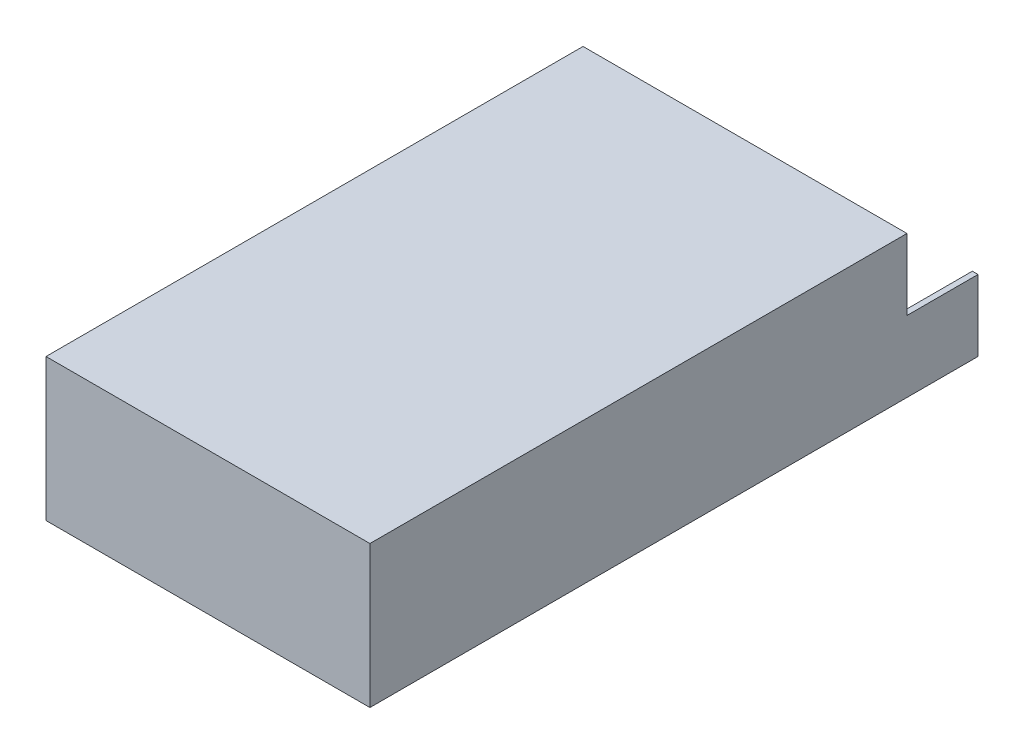
ISO-10303-21;
HEADER;
FILE_DESCRIPTION(('STEP AP214'),'2;1');
FILE_NAME('part.step','',(''),(''),'','','');
FILE_SCHEMA(('AUTOMOTIVE_DESIGN { 1 0 10303 214 1 1 1 1 }'));
ENDSEC;
DATA;
#1=APPLICATION_CONTEXT('core data for automotive mechanical design processes');
#2=APPLICATION_PROTOCOL_DEFINITION('international standard','automotive_design',2000,#1);
#3=PRODUCT_CONTEXT('',#1,'mechanical');
#4=PRODUCT('Part','Part','',(#3));
#5=PRODUCT_RELATED_PRODUCT_CATEGORY('part','',(#4));
#6=PRODUCT_DEFINITION_FORMATION('','',#4);
#7=PRODUCT_DEFINITION_CONTEXT('part definition',#1,'design');
#8=PRODUCT_DEFINITION('design','',#6,#7);
#9=PRODUCT_DEFINITION_SHAPE('','',#8);
#10=(LENGTH_UNIT() NAMED_UNIT(*) SI_UNIT(.MILLI.,.METRE.));
#11=(NAMED_UNIT(*) PLANE_ANGLE_UNIT() SI_UNIT($,.RADIAN.));
#12=(NAMED_UNIT(*) SI_UNIT($,.STERADIAN.) SOLID_ANGLE_UNIT());
#13=UNCERTAINTY_MEASURE_WITH_UNIT(LENGTH_MEASURE(1.E-05),#10,'distance_accuracy_value','');
#14=(GEOMETRIC_REPRESENTATION_CONTEXT(3) GLOBAL_UNCERTAINTY_ASSIGNED_CONTEXT((#13)) GLOBAL_UNIT_ASSIGNED_CONTEXT((#10,
#11,#12)) REPRESENTATION_CONTEXT('',''));
#15=CARTESIAN_POINT('',(0.,0.,0.));
#16=DIRECTION('',(0.,0.,1.));
#17=DIRECTION('',(1.,0.,0.));
#18=AXIS2_PLACEMENT_3D('',#15,#16,#17);
#19=CARTESIAN_POINT('',(0.,50.,-187.));
#20=DIRECTION('',(0.,0.,1.));
#21=DIRECTION('',(1.,0.,0.));
#22=AXIS2_PLACEMENT_3D('',#19,#20,#21);
#23=PLANE('',#22);
#24=DIRECTION('',(0.,1.,0.));
#25=VECTOR('',#24,1.);
#26=CARTESIAN_POINT('',(1.99999999999999,50.,-187.));
#27=LINE('',#26,#25);
#28=CARTESIAN_POINT('',(2.,25.,-187.));
#29=VERTEX_POINT('',#28);
#30=CARTESIAN_POINT('',(2.,48.,-187.));
#31=VERTEX_POINT('',#30);
#32=EDGE_CURVE('E205',#29,#31,#27,.T.);
#33=ORIENTED_EDGE('',*,*,#32,.F.);
#34=DIRECTION('',(1.,0.,0.));
#35=VECTOR('',#34,1.);
#36=CARTESIAN_POINT('',(0.,25.,-187.));
#37=LINE('',#36,#35);
#38=CARTESIAN_POINT('',(112.,25.,-187.));
#39=VERTEX_POINT('',#38);
#40=EDGE_CURVE('E123',#39,#29,#37,.F.);
#41=ORIENTED_EDGE('',*,*,#40,.F.);
#42=DIRECTION('',(0.,1.,0.));
#43=VECTOR('',#42,1.);
#44=CARTESIAN_POINT('',(112.,50.,-187.));
#45=LINE('',#44,#43);
#46=CARTESIAN_POINT('',(112.,48.,-187.));
#47=VERTEX_POINT('',#46);
#48=EDGE_CURVE('E130',#47,#39,#45,.F.);
#49=ORIENTED_EDGE('',*,*,#48,.F.);
#50=DIRECTION('',(1.,0.,0.));
#51=VECTOR('',#50,1.);
#52=CARTESIAN_POINT('',(0.,48.,-187.));
#53=LINE('',#52,#51);
#54=EDGE_CURVE('E110',#31,#47,#53,.T.);
#55=ORIENTED_EDGE('',*,*,#54,.F.);
#56=EDGE_LOOP('',(#33,#41,#49,#55));
#57=FACE_BOUND('',#56,.T.);
#58=ADVANCED_FACE('F17',(#57),#23,.T.);
#59=CARTESIAN_POINT('',(0.,48.,1.66533453693773E-13));
#60=DIRECTION('',(0.,-1.,0.));
#61=DIRECTION('',(0.,0.,-1.));
#62=AXIS2_PLACEMENT_3D('',#59,#60,#61);
#63=PLANE('',#62);
#64=DIRECTION('',(0.,0.,-1.));
#65=VECTOR('',#64,1.);
#66=CARTESIAN_POINT('',(1.99999999999999,48.,-1.11022302462516E-13));
#67=LINE('',#66,#65);
#68=CARTESIAN_POINT('',(2.,48.,-1.9999999999999));
#69=VERTEX_POINT('',#68);
#70=EDGE_CURVE('E203',#31,#69,#67,.F.);
#71=ORIENTED_EDGE('',*,*,#70,.F.);
#72=ORIENTED_EDGE('',*,*,#54,.T.);
#73=DIRECTION('',(0.,0.,1.));
#74=VECTOR('',#73,1.);
#75=CARTESIAN_POINT('',(112.,48.,1.66533453693773E-13));
#76=LINE('',#75,#74);
#77=CARTESIAN_POINT('',(112.,48.,-1.99999999999988));
#78=VERTEX_POINT('',#77);
#79=EDGE_CURVE('E126',#78,#47,#76,.F.);
#80=ORIENTED_EDGE('',*,*,#79,.F.);
#81=DIRECTION('',(-1.,0.,0.));
#82=VECTOR('',#81,1.);
#83=CARTESIAN_POINT('',(0.,48.,-1.99999999999984));
#84=LINE('',#83,#82);
#85=EDGE_CURVE('E115',#69,#78,#84,.F.);
#86=ORIENTED_EDGE('',*,*,#85,.F.);
#87=EDGE_LOOP('',(#71,#72,#80,#86));
#88=FACE_BOUND('',#87,.T.);
#89=ADVANCED_FACE('F127',(#88),#63,.T.);
#90=CARTESIAN_POINT('',(0.,50.,-1.99999999999984));
#91=DIRECTION('',(0.,0.,-1.));
#92=DIRECTION('',(-1.,0.,0.));
#93=AXIS2_PLACEMENT_3D('',#90,#91,#92);
#94=PLANE('',#93);
#95=ORIENTED_EDGE('',*,*,#85,.T.);
#96=DIRECTION('',(0.,1.,0.));
#97=VECTOR('',#96,1.);
#98=CARTESIAN_POINT('',(112.,50.,-2.));
#99=LINE('',#98,#97);
#100=CARTESIAN_POINT('',(112.,1.99999999999999,-1.99999999999996));
#101=VERTEX_POINT('',#100);
#102=EDGE_CURVE('E118',#101,#78,#99,.T.);
#103=ORIENTED_EDGE('',*,*,#102,.F.);
#104=DIRECTION('',(1.,0.,0.));
#105=VECTOR('',#104,1.);
#106=CARTESIAN_POINT('',(0.,2.,-2.));
#107=LINE('',#106,#105);
#108=CARTESIAN_POINT('',(2.,1.99999999999998,-1.99999999999995));
#109=VERTEX_POINT('',#108);
#110=EDGE_CURVE('E208',#101,#109,#107,.F.);
#111=ORIENTED_EDGE('',*,*,#110,.T.);
#112=DIRECTION('',(0.,1.,0.));
#113=VECTOR('',#112,1.);
#114=CARTESIAN_POINT('',(1.99999999999999,50.,-2.00000000000011));
#115=LINE('',#114,#113);
#116=EDGE_CURVE('E121',#69,#109,#115,.F.);
#117=ORIENTED_EDGE('',*,*,#116,.F.);
#118=EDGE_LOOP('',(#95,#103,#111,#117));
#119=FACE_BOUND('',#118,.T.);
#120=ADVANCED_FACE('F116',(#119),#94,.T.);
#121=CARTESIAN_POINT('',(0.,25.,-214.));
#122=DIRECTION('',(0.,-1.,0.));
#123=DIRECTION('',(0.,0.,-1.));
#124=AXIS2_PLACEMENT_3D('',#121,#122,#123);
#125=PLANE('',#124);
#126=ORIENTED_EDGE('',*,*,#40,.T.);
#127=DIRECTION('',(0.,0.,-1.));
#128=VECTOR('',#127,1.);
#129=CARTESIAN_POINT('',(1.99999999999999,25.,-1.11022302462516E-13));
#130=LINE('',#129,#128);
#131=CARTESIAN_POINT('',(2.,25.,-189.));
#132=VERTEX_POINT('',#131);
#133=EDGE_CURVE('E196',#132,#29,#130,.F.);
#134=ORIENTED_EDGE('',*,*,#133,.F.);
#135=DIRECTION('',(1.,0.,0.));
#136=VECTOR('',#135,1.);
#137=CARTESIAN_POINT('',(0.,25.,-189.));
#138=LINE('',#137,#136);
#139=CARTESIAN_POINT('',(112.,25.,-189.));
#140=VERTEX_POINT('',#139);
#141=EDGE_CURVE('E188',#132,#140,#138,.T.);
#142=ORIENTED_EDGE('',*,*,#141,.T.);
#143=DIRECTION('',(0.,0.,1.));
#144=VECTOR('',#143,1.);
#145=CARTESIAN_POINT('',(112.,25.,1.66533453693773E-13));
#146=LINE('',#145,#144);
#147=EDGE_CURVE('E211',#39,#140,#146,.F.);
#148=ORIENTED_EDGE('',*,*,#147,.F.);
#149=EDGE_LOOP('',(#126,#134,#142,#148));
#150=FACE_BOUND('',#149,.T.);
#151=ADVANCED_FACE('F216',(#150),#125,.T.);
#152=CARTESIAN_POINT('',(112.,50.,1.66533453693773E-13));
#153=DIRECTION('',(-1.,0.,0.));
#154=DIRECTION('',(0.,0.,1.));
#155=AXIS2_PLACEMENT_3D('',#152,#153,#154);
#156=PLANE('',#155);
#157=ORIENTED_EDGE('',*,*,#147,.T.);
#158=DIRECTION('',(0.,0.,-1.));
#159=VECTOR('',#158,1.);
#160=CARTESIAN_POINT('',(112.,25.,-214.));
#161=LINE('',#160,#159);
#162=CARTESIAN_POINT('',(112.,25.,-214.));
#163=VERTEX_POINT('',#162);
#164=EDGE_CURVE('E176',#140,#163,#161,.T.);
#165=ORIENTED_EDGE('',*,*,#164,.T.);
#166=DIRECTION('',(0.,1.,0.));
#167=VECTOR('',#166,1.);
#168=CARTESIAN_POINT('',(112.,50.,-214.));
#169=LINE('',#168,#167);
#170=CARTESIAN_POINT('',(112.,2.,-214.));
#171=VERTEX_POINT('',#170);
#172=EDGE_CURVE('E247',#163,#171,#169,.F.);
#173=ORIENTED_EDGE('',*,*,#172,.T.);
#174=DIRECTION('',(0.,0.,-1.));
#175=VECTOR('',#174,1.);
#176=CARTESIAN_POINT('',(112.,2.,0.));
#177=LINE('',#176,#175);
#178=EDGE_CURVE('E135',#171,#101,#177,.F.);
#179=ORIENTED_EDGE('',*,*,#178,.T.);
#180=ORIENTED_EDGE('',*,*,#102,.T.);
#181=ORIENTED_EDGE('',*,*,#79,.T.);
#182=ORIENTED_EDGE('',*,*,#48,.T.);
#183=EDGE_LOOP('',(#157,#165,#173,#179,#180,#181,#182));
#184=FACE_BOUND('',#183,.T.);
#185=ADVANCED_FACE('F133',(#184),#156,.T.);
#186=CARTESIAN_POINT('',(0.,2.,0.));
#187=DIRECTION('',(0.,-1.,0.));
#188=DIRECTION('',(0.,0.,-1.));
#189=AXIS2_PLACEMENT_3D('',#186,#187,#188);
#190=PLANE('',#189);
#191=ORIENTED_EDGE('',*,*,#110,.F.);
#192=ORIENTED_EDGE('',*,*,#178,.F.);
#193=DIRECTION('',(1.,0.,0.));
#194=VECTOR('',#193,1.);
#195=CARTESIAN_POINT('',(0.,2.,-214.));
#196=LINE('',#195,#194);
#197=CARTESIAN_POINT('',(2.,2.,-214.));
#198=VERTEX_POINT('',#197);
#199=EDGE_CURVE('E245',#171,#198,#196,.F.);
#200=ORIENTED_EDGE('',*,*,#199,.T.);
#201=DIRECTION('',(0.,0.,-1.));
#202=VECTOR('',#201,1.);
#203=CARTESIAN_POINT('',(1.99999999999999,2.,-1.11022302462516E-13));
#204=LINE('',#203,#202);
#205=EDGE_CURVE('E199',#109,#198,#204,.T.);
#206=ORIENTED_EDGE('',*,*,#205,.F.);
#207=EDGE_LOOP('',(#191,#192,#200,#206));
#208=FACE_BOUND('',#207,.T.);
#209=CARTESIAN_POINT('',(32.,1.99999999999999,-32.));
#210=DIRECTION('',(0.,-1.,0.));
#211=DIRECTION('',(0.,0.,-1.));
#212=AXIS2_PLACEMENT_3D('',#209,#210,#211);
#213=CIRCLE('',#212,2.15);
#214=CARTESIAN_POINT('',(32.,1.99999999999999,-34.15));
#215=VERTEX_POINT('',#214);
#216=EDGE_CURVE('E159',#215,#215,#213,.T.);
#217=ORIENTED_EDGE('',*,*,#216,.T.);
#218=EDGE_LOOP('',(#217));
#219=FACE_BOUND('',#218,.T.);
#220=CARTESIAN_POINT('',(82.0000000000001,1.99999999999996,-182.));
#221=DIRECTION('',(0.,-1.,0.));
#222=DIRECTION('',(0.,0.,-1.));
#223=AXIS2_PLACEMENT_3D('',#220,#221,#222);
#224=CIRCLE('',#223,2.14999999999999);
#225=CARTESIAN_POINT('',(82.0000000000001,1.99999999999996,-184.15));
#226=VERTEX_POINT('',#225);
#227=EDGE_CURVE('E163',#226,#226,#224,.T.);
#228=ORIENTED_EDGE('',*,*,#227,.T.);
#229=EDGE_LOOP('',(#228));
#230=FACE_BOUND('',#229,.T.);
#231=CARTESIAN_POINT('',(82.0000000000001,2.,-32.));
#232=DIRECTION('',(0.,-1.,0.));
#233=DIRECTION('',(0.,0.,-1.));
#234=AXIS2_PLACEMENT_3D('',#231,#232,#233);
#235=CIRCLE('',#234,2.15);
#236=CARTESIAN_POINT('',(82.0000000000001,2.,-34.15));
#237=VERTEX_POINT('',#236);
#238=EDGE_CURVE('E166',#237,#237,#235,.T.);
#239=ORIENTED_EDGE('',*,*,#238,.T.);
#240=EDGE_LOOP('',(#239));
#241=FACE_BOUND('',#240,.T.);
#242=CARTESIAN_POINT('',(32.0000000000001,2.,-182.));
#243=DIRECTION('',(0.,-1.,0.));
#244=DIRECTION('',(0.,0.,-1.));
#245=AXIS2_PLACEMENT_3D('',#242,#243,#244);
#246=CIRCLE('',#245,2.15000000000001);
#247=CARTESIAN_POINT('',(32.0000000000001,2.,-184.15));
#248=VERTEX_POINT('',#247);
#249=EDGE_CURVE('E168',#248,#248,#246,.T.);
#250=ORIENTED_EDGE('',*,*,#249,.T.);
#251=EDGE_LOOP('',(#250));
#252=FACE_BOUND('',#251,.T.);
#253=CARTESIAN_POINT('',(57.0000000000001,1.99999999999996,-107.));
#254=DIRECTION('',(0.,-1.,0.));
#255=DIRECTION('',(0.,0.,-1.));
#256=AXIS2_PLACEMENT_3D('',#253,#254,#255);
#257=CIRCLE('',#256,2.15);
#258=CARTESIAN_POINT('',(57.0000000000001,1.99999999999996,-109.15));
#259=VERTEX_POINT('',#258);
#260=EDGE_CURVE('E20',#259,#259,#257,.T.);
#261=ORIENTED_EDGE('',*,*,#260,.T.);
#262=EDGE_LOOP('',(#261));
#263=FACE_BOUND('',#262,.T.);
#264=ADVANCED_FACE('F289',(#208,#219,#230,#241,#252,#263),#190,.F.);
#265=CARTESIAN_POINT('',(1.99999999999999,50.,-1.11022302462516E-13));
#266=DIRECTION('',(1.,0.,0.));
#267=DIRECTION('',(0.,0.,-1.));
#268=AXIS2_PLACEMENT_3D('',#265,#266,#267);
#269=PLANE('',#268);
#270=DIRECTION('',(0.,0.,-1.));
#271=VECTOR('',#270,1.);
#272=CARTESIAN_POINT('',(1.99999999999999,25.,-214.));
#273=LINE('',#272,#271);
#274=CARTESIAN_POINT('',(2.,25.,-214.));
#275=VERTEX_POINT('',#274);
#276=EDGE_CURVE('E193',#275,#132,#273,.F.);
#277=ORIENTED_EDGE('',*,*,#276,.T.);
#278=ORIENTED_EDGE('',*,*,#133,.T.);
#279=ORIENTED_EDGE('',*,*,#32,.T.);
#280=ORIENTED_EDGE('',*,*,#70,.T.);
#281=ORIENTED_EDGE('',*,*,#116,.T.);
#282=ORIENTED_EDGE('',*,*,#205,.T.);
#283=DIRECTION('',(0.,1.,0.));
#284=VECTOR('',#283,1.);
#285=CARTESIAN_POINT('',(2.,50.,-214.));
#286=LINE('',#285,#284);
#287=EDGE_CURVE('E243',#198,#275,#286,.T.);
#288=ORIENTED_EDGE('',*,*,#287,.T.);
#289=EDGE_LOOP('',(#277,#278,#279,#280,#281,#282,#288));
#290=FACE_BOUND('',#289,.T.);
#291=ADVANCED_FACE('F293',(#290),#269,.T.);
#292=CARTESIAN_POINT('',(0.,25.,-214.));
#293=DIRECTION('',(0.,-1.,0.));
#294=DIRECTION('',(0.,0.,-1.));
#295=AXIS2_PLACEMENT_3D('',#292,#293,#294);
#296=PLANE('',#295);
#297=ORIENTED_EDGE('',*,*,#276,.F.);
#298=DIRECTION('',(1.,0.,0.));
#299=VECTOR('',#298,1.);
#300=CARTESIAN_POINT('',(0.,25.,-214.));
#301=LINE('',#300,#299);
#302=CARTESIAN_POINT('',(0.,25.,-214.));
#303=VERTEX_POINT('',#302);
#304=EDGE_CURVE('E240',#275,#303,#301,.F.);
#305=ORIENTED_EDGE('',*,*,#304,.T.);
#306=DIRECTION('',(0.,0.,-1.));
#307=VECTOR('',#306,1.);
#308=CARTESIAN_POINT('',(0.,25.,1.66533453693773E-13));
#309=LINE('',#308,#307);
#310=CARTESIAN_POINT('',(0.,25.,-189.));
#311=VERTEX_POINT('',#310);
#312=EDGE_CURVE('E254',#303,#311,#309,.F.);
#313=ORIENTED_EDGE('',*,*,#312,.T.);
#314=DIRECTION('',(1.,0.,0.));
#315=VECTOR('',#314,1.);
#316=CARTESIAN_POINT('',(0.,25.,-189.));
#317=LINE('',#316,#315);
#318=EDGE_CURVE('E190',#311,#132,#317,.T.);
#319=ORIENTED_EDGE('',*,*,#318,.T.);
#320=EDGE_LOOP('',(#297,#305,#313,#319));
#321=FACE_BOUND('',#320,.T.);
#322=ADVANCED_FACE('F295',(#321),#296,.F.);
#323=CARTESIAN_POINT('',(0.,50.,-189.));
#324=DIRECTION('',(0.,0.,1.));
#325=DIRECTION('',(1.,0.,0.));
#326=AXIS2_PLACEMENT_3D('',#323,#324,#325);
#327=PLANE('',#326);
#328=DIRECTION('',(1.,0.,0.));
#329=VECTOR('',#328,1.);
#330=CARTESIAN_POINT('',(0.,25.,-189.));
#331=LINE('',#330,#329);
#332=CARTESIAN_POINT('',(114.,25.,-189.));
#333=VERTEX_POINT('',#332);
#334=EDGE_CURVE('E181',#333,#140,#331,.F.);
#335=ORIENTED_EDGE('',*,*,#334,.T.);
#336=ORIENTED_EDGE('',*,*,#141,.F.);
#337=ORIENTED_EDGE('',*,*,#318,.F.);
#338=DIRECTION('',(0.,1.,0.));
#339=VECTOR('',#338,1.);
#340=CARTESIAN_POINT('',(0.,50.,-189.));
#341=LINE('',#340,#339);
#342=CARTESIAN_POINT('',(0.,50.,-189.));
#343=VERTEX_POINT('',#342);
#344=EDGE_CURVE('E253',#311,#343,#341,.T.);
#345=ORIENTED_EDGE('',*,*,#344,.T.);
#346=DIRECTION('',(1.,0.,0.));
#347=VECTOR('',#346,1.);
#348=CARTESIAN_POINT('',(0.,50.,-189.));
#349=LINE('',#348,#347);
#350=CARTESIAN_POINT('',(114.,50.,-189.));
#351=VERTEX_POINT('',#350);
#352=EDGE_CURVE('E173',#343,#351,#349,.T.);
#353=ORIENTED_EDGE('',*,*,#352,.T.);
#354=DIRECTION('',(0.,1.,0.));
#355=VECTOR('',#354,1.);
#356=CARTESIAN_POINT('',(114.,50.,-189.));
#357=LINE('',#356,#355);
#358=EDGE_CURVE('E222',#351,#333,#357,.F.);
#359=ORIENTED_EDGE('',*,*,#358,.T.);
#360=EDGE_LOOP('',(#335,#336,#337,#345,#353,#359));
#361=FACE_BOUND('',#360,.T.);
#362=ADVANCED_FACE('F220',(#361),#327,.F.);
#363=CARTESIAN_POINT('',(0.,25.,-214.));
#364=DIRECTION('',(0.,-1.,0.));
#365=DIRECTION('',(0.,0.,-1.));
#366=AXIS2_PLACEMENT_3D('',#363,#364,#365);
#367=PLANE('',#366);
#368=ORIENTED_EDGE('',*,*,#334,.F.);
#369=DIRECTION('',(0.,0.,1.));
#370=VECTOR('',#369,1.);
#371=CARTESIAN_POINT('',(114.,25.,-1.11022302462516E-13));
#372=LINE('',#371,#370);
#373=CARTESIAN_POINT('',(114.,25.,-214.));
#374=VERTEX_POINT('',#373);
#375=EDGE_CURVE('E227',#333,#374,#372,.F.);
#376=ORIENTED_EDGE('',*,*,#375,.T.);
#377=DIRECTION('',(1.,0.,0.));
#378=VECTOR('',#377,1.);
#379=CARTESIAN_POINT('',(0.,25.,-214.));
#380=LINE('',#379,#378);
#381=EDGE_CURVE('E249',#374,#163,#380,.F.);
#382=ORIENTED_EDGE('',*,*,#381,.T.);
#383=ORIENTED_EDGE('',*,*,#164,.F.);
#384=EDGE_LOOP('',(#368,#376,#382,#383));
#385=FACE_BOUND('',#384,.T.);
#386=ADVANCED_FACE('F225',(#385),#367,.F.);
#387=CARTESIAN_POINT('',(0.,50.,1.66533453693773E-13));
#388=DIRECTION('',(0.,-1.,0.));
#389=DIRECTION('',(0.,0.,-1.));
#390=AXIS2_PLACEMENT_3D('',#387,#388,#389);
#391=PLANE('',#390);
#392=ORIENTED_EDGE('',*,*,#352,.F.);
#393=DIRECTION('',(0.,0.,-1.));
#394=VECTOR('',#393,1.);
#395=CARTESIAN_POINT('',(0.,50.,1.66533453693773E-13));
#396=LINE('',#395,#394);
#397=CARTESIAN_POINT('',(0.,50.,0.));
#398=VERTEX_POINT('',#397);
#399=EDGE_CURVE('E162',#343,#398,#396,.F.);
#400=ORIENTED_EDGE('',*,*,#399,.T.);
#401=DIRECTION('',(-1.,0.,0.));
#402=VECTOR('',#401,1.);
#403=CARTESIAN_POINT('',(0.,50.,1.66533453693773E-13));
#404=LINE('',#403,#402);
#405=CARTESIAN_POINT('',(114.,50.,0.));
#406=VERTEX_POINT('',#405);
#407=EDGE_CURVE('E261',#398,#406,#404,.F.);
#408=ORIENTED_EDGE('',*,*,#407,.T.);
#409=DIRECTION('',(0.,0.,1.));
#410=VECTOR('',#409,1.);
#411=CARTESIAN_POINT('',(114.,50.,-1.11022302462516E-13));
#412=LINE('',#411,#410);
#413=EDGE_CURVE('E235',#406,#351,#412,.F.);
#414=ORIENTED_EDGE('',*,*,#413,.T.);
#415=EDGE_LOOP('',(#392,#400,#408,#414));
#416=FACE_BOUND('',#415,.T.);
#417=ADVANCED_FACE('F259',(#416),#391,.F.);
#418=CARTESIAN_POINT('',(57.0000000000001,0.,-107.));
#419=DIRECTION('',(0.,-1.,0.));
#420=DIRECTION('',(0.,0.,-1.));
#421=AXIS2_PLACEMENT_3D('',#418,#419,#420);
#422=CYLINDRICAL_SURFACE('',#421,2.15);
#423=CARTESIAN_POINT('',(57.0000000000001,0.,-107.));
#424=DIRECTION('',(0.,-1.,0.));
#425=DIRECTION('',(0.,0.,-1.));
#426=AXIS2_PLACEMENT_3D('',#423,#424,#425);
#427=CIRCLE('',#426,2.15);
#428=CARTESIAN_POINT('',(57.0000000000001,0.,-109.15));
#429=VERTEX_POINT('',#428);
#430=EDGE_CURVE('E156',#429,#429,#427,.F.);
#431=ORIENTED_EDGE('',*,*,#430,.F.);
#432=EDGE_LOOP('',(#431));
#433=FACE_BOUND('',#432,.T.);
#434=ORIENTED_EDGE('',*,*,#260,.F.);
#435=EDGE_LOOP('',(#434));
#436=FACE_BOUND('',#435,.T.);
#437=ADVANCED_FACE('F333',(#433,#436),#422,.F.);
#438=CARTESIAN_POINT('',(32.0000000000001,0.,-182.));
#439=DIRECTION('',(0.,-1.,0.));
#440=DIRECTION('',(0.,0.,-1.));
#441=AXIS2_PLACEMENT_3D('',#438,#439,#440);
#442=CYLINDRICAL_SURFACE('',#441,2.15000000000001);
#443=CARTESIAN_POINT('',(32.0000000000001,0.,-182.));
#444=DIRECTION('',(0.,-1.,0.));
#445=DIRECTION('',(0.,0.,-1.));
#446=AXIS2_PLACEMENT_3D('',#443,#444,#445);
#447=CIRCLE('',#446,2.15000000000001);
#448=CARTESIAN_POINT('',(32.0000000000001,0.,-184.15));
#449=VERTEX_POINT('',#448);
#450=EDGE_CURVE('E153',#449,#449,#447,.F.);
#451=ORIENTED_EDGE('',*,*,#450,.F.);
#452=EDGE_LOOP('',(#451));
#453=FACE_BOUND('',#452,.T.);
#454=ORIENTED_EDGE('',*,*,#249,.F.);
#455=EDGE_LOOP('',(#454));
#456=FACE_BOUND('',#455,.T.);
#457=ADVANCED_FACE('F329',(#453,#456),#442,.F.);
#458=CARTESIAN_POINT('',(82.0000000000001,0.,-32.));
#459=DIRECTION('',(0.,-1.,0.));
#460=DIRECTION('',(0.,0.,-1.));
#461=AXIS2_PLACEMENT_3D('',#458,#459,#460);
#462=CYLINDRICAL_SURFACE('',#461,2.15);
#463=CARTESIAN_POINT('',(82.0000000000001,0.,-32.));
#464=DIRECTION('',(0.,-1.,0.));
#465=DIRECTION('',(0.,0.,-1.));
#466=AXIS2_PLACEMENT_3D('',#463,#464,#465);
#467=CIRCLE('',#466,2.15);
#468=CARTESIAN_POINT('',(82.0000000000001,0.,-34.15));
#469=VERTEX_POINT('',#468);
#470=EDGE_CURVE('E150',#469,#469,#467,.F.);
#471=ORIENTED_EDGE('',*,*,#470,.F.);
#472=EDGE_LOOP('',(#471));
#473=FACE_BOUND('',#472,.T.);
#474=ORIENTED_EDGE('',*,*,#238,.F.);
#475=EDGE_LOOP('',(#474));
#476=FACE_BOUND('',#475,.T.);
#477=ADVANCED_FACE('F325',(#473,#476),#462,.F.);
#478=CARTESIAN_POINT('',(82.0000000000001,0.,-182.));
#479=DIRECTION('',(0.,-1.,0.));
#480=DIRECTION('',(0.,0.,-1.));
#481=AXIS2_PLACEMENT_3D('',#478,#479,#480);
#482=CYLINDRICAL_SURFACE('',#481,2.14999999999999);
#483=CARTESIAN_POINT('',(82.0000000000001,0.,-182.));
#484=DIRECTION('',(0.,-1.,0.));
#485=DIRECTION('',(0.,0.,-1.));
#486=AXIS2_PLACEMENT_3D('',#483,#484,#485);
#487=CIRCLE('',#486,2.14999999999999);
#488=CARTESIAN_POINT('',(82.0000000000001,0.,-184.15));
#489=VERTEX_POINT('',#488);
#490=EDGE_CURVE('E147',#489,#489,#487,.F.);
#491=ORIENTED_EDGE('',*,*,#490,.F.);
#492=EDGE_LOOP('',(#491));
#493=FACE_BOUND('',#492,.T.);
#494=ORIENTED_EDGE('',*,*,#227,.F.);
#495=EDGE_LOOP('',(#494));
#496=FACE_BOUND('',#495,.T.);
#497=ADVANCED_FACE('F321',(#493,#496),#482,.F.);
#498=CARTESIAN_POINT('',(32.,0.,-32.));
#499=DIRECTION('',(0.,-1.,0.));
#500=DIRECTION('',(0.,0.,-1.));
#501=AXIS2_PLACEMENT_3D('',#498,#499,#500);
#502=CYLINDRICAL_SURFACE('',#501,2.15);
#503=CARTESIAN_POINT('',(32.,0.,-32.));
#504=DIRECTION('',(0.,-1.,0.));
#505=DIRECTION('',(0.,0.,-1.));
#506=AXIS2_PLACEMENT_3D('',#503,#504,#505);
#507=CIRCLE('',#506,2.15);
#508=CARTESIAN_POINT('',(32.,0.,-34.15));
#509=VERTEX_POINT('',#508);
#510=EDGE_CURVE('E143',#509,#509,#507,.F.);
#511=ORIENTED_EDGE('',*,*,#510,.F.);
#512=EDGE_LOOP('',(#511));
#513=FACE_BOUND('',#512,.T.);
#514=ORIENTED_EDGE('',*,*,#216,.F.);
#515=EDGE_LOOP('',(#514));
#516=FACE_BOUND('',#515,.T.);
#517=ADVANCED_FACE('F318',(#513,#516),#502,.F.);
#518=CARTESIAN_POINT('',(0.,50.,1.66533453693773E-13));
#519=DIRECTION('',(1.,0.,0.));
#520=DIRECTION('',(0.,0.,-1.));
#521=AXIS2_PLACEMENT_3D('',#518,#519,#520);
#522=PLANE('',#521);
#523=ORIENTED_EDGE('',*,*,#312,.F.);
#524=DIRECTION('',(0.,1.,0.));
#525=VECTOR('',#524,1.);
#526=CARTESIAN_POINT('',(0.,50.,-214.));
#527=LINE('',#526,#525);
#528=CARTESIAN_POINT('',(0.,0.,-214.));
#529=VERTEX_POINT('',#528);
#530=EDGE_CURVE('E251',#303,#529,#527,.F.);
#531=ORIENTED_EDGE('',*,*,#530,.T.);
#532=DIRECTION('',(0.,0.,-1.));
#533=VECTOR('',#532,1.);
#534=CARTESIAN_POINT('',(0.,0.,0.));
#535=LINE('',#534,#533);
#536=CARTESIAN_POINT('',(0.,0.,0.));
#537=VERTEX_POINT('',#536);
#538=EDGE_CURVE('E146',#537,#529,#535,.T.);
#539=ORIENTED_EDGE('',*,*,#538,.F.);
#540=DIRECTION('',(0.,1.,0.));
#541=VECTOR('',#540,1.);
#542=CARTESIAN_POINT('',(0.,50.,1.66533453693773E-13));
#543=LINE('',#542,#541);
#544=EDGE_CURVE('E233',#537,#398,#543,.T.);
#545=ORIENTED_EDGE('',*,*,#544,.T.);
#546=ORIENTED_EDGE('',*,*,#399,.F.);
#547=ORIENTED_EDGE('',*,*,#344,.F.);
#548=EDGE_LOOP('',(#523,#531,#539,#545,#546,#547));
#549=FACE_BOUND('',#548,.T.);
#550=ADVANCED_FACE('F265',(#549),#522,.F.);
#551=CARTESIAN_POINT('',(0.,50.,-214.));
#552=DIRECTION('',(0.,0.,1.));
#553=DIRECTION('',(1.,0.,0.));
#554=AXIS2_PLACEMENT_3D('',#551,#552,#553);
#555=PLANE('',#554);
#556=ORIENTED_EDGE('',*,*,#287,.F.);
#557=ORIENTED_EDGE('',*,*,#199,.F.);
#558=ORIENTED_EDGE('',*,*,#172,.F.);
#559=ORIENTED_EDGE('',*,*,#381,.F.);
#560=DIRECTION('',(0.,1.,0.));
#561=VECTOR('',#560,1.);
#562=CARTESIAN_POINT('',(114.,50.,-214.));
#563=LINE('',#562,#561);
#564=CARTESIAN_POINT('',(114.,0.,-214.));
#565=VERTEX_POINT('',#564);
#566=EDGE_CURVE('E231',#374,#565,#563,.F.);
#567=ORIENTED_EDGE('',*,*,#566,.T.);
#568=DIRECTION('',(1.,0.,0.));
#569=VECTOR('',#568,1.);
#570=CARTESIAN_POINT('',(0.,0.,-214.));
#571=LINE('',#570,#569);
#572=EDGE_CURVE('E273',#529,#565,#571,.T.);
#573=ORIENTED_EDGE('',*,*,#572,.F.);
#574=ORIENTED_EDGE('',*,*,#530,.F.);
#575=ORIENTED_EDGE('',*,*,#304,.F.);
#576=EDGE_LOOP('',(#556,#557,#558,#559,#567,#573,#574,#575));
#577=FACE_BOUND('',#576,.T.);
#578=ADVANCED_FACE('F284',(#577),#555,.F.);
#579=CARTESIAN_POINT('',(114.,50.,-1.11022302462516E-13));
#580=DIRECTION('',(-1.,0.,0.));
#581=DIRECTION('',(0.,0.,1.));
#582=AXIS2_PLACEMENT_3D('',#579,#580,#581);
#583=PLANE('',#582);
#584=ORIENTED_EDGE('',*,*,#375,.F.);
#585=ORIENTED_EDGE('',*,*,#358,.F.);
#586=ORIENTED_EDGE('',*,*,#413,.F.);
#587=DIRECTION('',(0.,1.,0.));
#588=VECTOR('',#587,1.);
#589=CARTESIAN_POINT('',(114.,50.,1.66533453693773E-13));
#590=LINE('',#589,#588);
#591=CARTESIAN_POINT('',(114.,0.,-1.66533453693773E-13));
#592=VERTEX_POINT('',#591);
#593=EDGE_CURVE('E35',#406,#592,#590,.F.);
#594=ORIENTED_EDGE('',*,*,#593,.T.);
#595=DIRECTION('',(0.,0.,-1.));
#596=VECTOR('',#595,1.);
#597=CARTESIAN_POINT('',(114.,0.,0.));
#598=LINE('',#597,#596);
#599=EDGE_CURVE('E26',#565,#592,#598,.F.);
#600=ORIENTED_EDGE('',*,*,#599,.F.);
#601=ORIENTED_EDGE('',*,*,#566,.F.);
#602=EDGE_LOOP('',(#584,#585,#586,#594,#600,#601));
#603=FACE_BOUND('',#602,.T.);
#604=ADVANCED_FACE('F230',(#603),#583,.F.);
#605=CARTESIAN_POINT('',(0.,50.,1.66533453693773E-13));
#606=DIRECTION('',(0.,0.,-1.));
#607=DIRECTION('',(-1.,0.,0.));
#608=AXIS2_PLACEMENT_3D('',#605,#606,#607);
#609=PLANE('',#608);
#610=ORIENTED_EDGE('',*,*,#593,.F.);
#611=ORIENTED_EDGE('',*,*,#407,.F.);
#612=ORIENTED_EDGE('',*,*,#544,.F.);
#613=DIRECTION('',(1.,0.,0.));
#614=VECTOR('',#613,1.);
#615=CARTESIAN_POINT('',(0.,0.,-2.77555756156289E-13));
#616=LINE('',#615,#614);
#617=EDGE_CURVE('E11',#592,#537,#616,.F.);
#618=ORIENTED_EDGE('',*,*,#617,.F.);
#619=EDGE_LOOP('',(#610,#611,#612,#618));
#620=FACE_BOUND('',#619,.T.);
#621=ADVANCED_FACE('F268',(#620),#609,.F.);
#622=CARTESIAN_POINT('',(0.,0.,0.));
#623=DIRECTION('',(0.,-1.,0.));
#624=DIRECTION('',(0.,0.,-1.));
#625=AXIS2_PLACEMENT_3D('',#622,#623,#624);
#626=PLANE('',#625);
#627=ORIENTED_EDGE('',*,*,#599,.T.);
#628=ORIENTED_EDGE('',*,*,#617,.T.);
#629=ORIENTED_EDGE('',*,*,#538,.T.);
#630=ORIENTED_EDGE('',*,*,#572,.T.);
#631=EDGE_LOOP('',(#627,#628,#629,#630));
#632=FACE_BOUND('',#631,.T.);
#633=ORIENTED_EDGE('',*,*,#510,.T.);
#634=EDGE_LOOP('',(#633));
#635=FACE_BOUND('',#634,.T.);
#636=ORIENTED_EDGE('',*,*,#490,.T.);
#637=EDGE_LOOP('',(#636));
#638=FACE_BOUND('',#637,.T.);
#639=ORIENTED_EDGE('',*,*,#470,.T.);
#640=EDGE_LOOP('',(#639));
#641=FACE_BOUND('',#640,.T.);
#642=ORIENTED_EDGE('',*,*,#450,.T.);
#643=EDGE_LOOP('',(#642));
#644=FACE_BOUND('',#643,.T.);
#645=ORIENTED_EDGE('',*,*,#430,.T.);
#646=EDGE_LOOP('',(#645));
#647=FACE_BOUND('',#646,.T.);
#648=ADVANCED_FACE('F278',(#632,#635,#638,#641,#644,#647),#626,.T.);
#649=CLOSED_SHELL('',(#58,#89,#120,#151,#185,#264,#291,#322,#362,#386,#417,#437,#457,#477,#497,
#517,#550,#578,#604,#621,#648));
#650=MANIFOLD_SOLID_BREP('B1',#649);
#651=ADVANCED_BREP_SHAPE_REPRESENTATION('',(#18,#650),#14);
#652=SHAPE_DEFINITION_REPRESENTATION(#9,#651);
ENDSEC;
END-ISO-10303-21;
